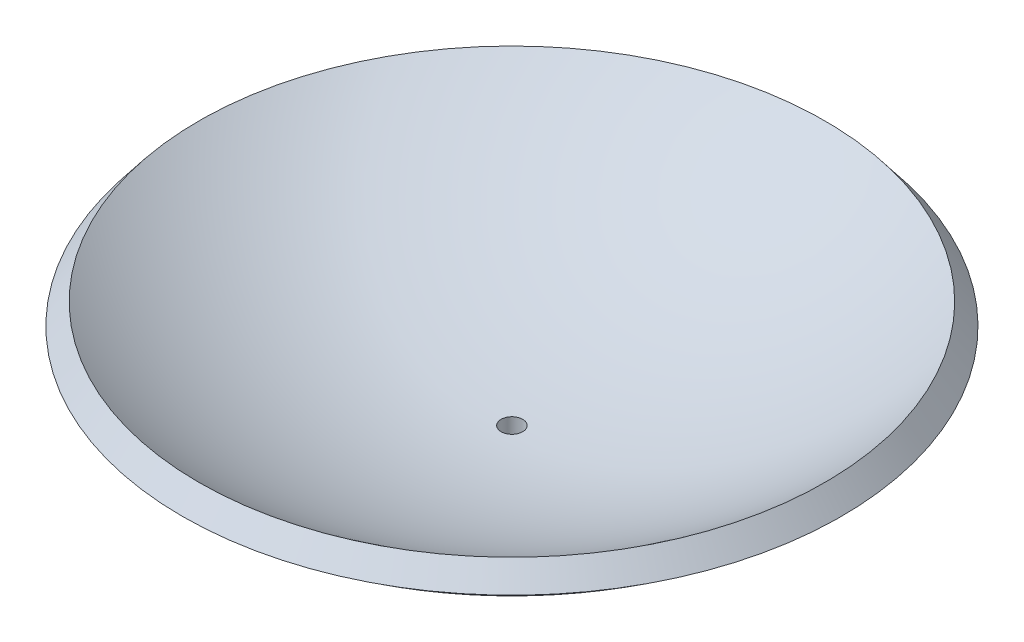
ISO-10303-21;
HEADER;
FILE_DESCRIPTION(('STEP AP214'),'2;1');
FILE_NAME('part.step','',(''),(''),'','','');
FILE_SCHEMA(('AUTOMOTIVE_DESIGN { 1 0 10303 214 1 1 1 1 }'));
ENDSEC;
DATA;
#1=APPLICATION_CONTEXT('core data for automotive mechanical design processes');
#2=APPLICATION_PROTOCOL_DEFINITION('international standard','automotive_design',2000,#1);
#3=PRODUCT_CONTEXT('',#1,'mechanical');
#4=PRODUCT('Part','Part','',(#3));
#5=PRODUCT_RELATED_PRODUCT_CATEGORY('part','',(#4));
#6=PRODUCT_DEFINITION_FORMATION('','',#4);
#7=PRODUCT_DEFINITION_CONTEXT('part definition',#1,'design');
#8=PRODUCT_DEFINITION('design','',#6,#7);
#9=PRODUCT_DEFINITION_SHAPE('','',#8);
#10=(LENGTH_UNIT() NAMED_UNIT(*) SI_UNIT(.MILLI.,.METRE.));
#11=(NAMED_UNIT(*) PLANE_ANGLE_UNIT() SI_UNIT($,.RADIAN.));
#12=(NAMED_UNIT(*) SI_UNIT($,.STERADIAN.) SOLID_ANGLE_UNIT());
#13=UNCERTAINTY_MEASURE_WITH_UNIT(LENGTH_MEASURE(1.E-05),#10,'distance_accuracy_value','');
#14=(GEOMETRIC_REPRESENTATION_CONTEXT(3) GLOBAL_UNCERTAINTY_ASSIGNED_CONTEXT((#13)) GLOBAL_UNIT_ASSIGNED_CONTEXT((#10,
#11,#12)) REPRESENTATION_CONTEXT('',''));
#15=CARTESIAN_POINT('',(0.,0.,0.));
#16=DIRECTION('',(0.,0.,1.));
#17=DIRECTION('',(1.,0.,0.));
#18=AXIS2_PLACEMENT_3D('',#15,#16,#17);
#19=CARTESIAN_POINT('',(0.,132.713404512541,0.));
#20=DIRECTION('',(0.,1.,0.));
#21=DIRECTION('',(-1.,0.,0.));
#22=AXIS2_PLACEMENT_3D('',#19,#20,#21);
#23=SPHERICAL_SURFACE('',#22,120.65);
#24=CARTESIAN_POINT('',(0.,12.0904124143922,0.));
#25=DIRECTION('',(0.,1.,0.));
#26=DIRECTION('',(0.,0.,1.));
#27=AXIS2_PLACEMENT_3D('',#24,#25,#26);
#28=CIRCLE('',#27,2.5527);
#29=CARTESIAN_POINT('',(0.,12.0904124143922,2.5527));
#30=VERTEX_POINT('',#29);
#31=EDGE_CURVE('E38',#30,#30,#28,.T.);
#32=ORIENTED_EDGE('',*,*,#31,.F.);
#33=EDGE_LOOP('',(#32));
#34=FACE_BOUND('',#33,.T.);
#35=CARTESIAN_POINT('',(0.,37.4634045125407,0.));
#36=DIRECTION('',(0.,1.,0.));
#37=DIRECTION('',(0.,0.,1.));
#38=AXIS2_PLACEMENT_3D('',#35,#36,#37);
#39=CIRCLE('',#38,74.0530890645353);
#40=CARTESIAN_POINT('',(0.,37.4634045125407,74.0530890645353));
#41=VERTEX_POINT('',#40);
#42=EDGE_CURVE('E10',#41,#41,#39,.T.);
#43=ORIENTED_EDGE('',*,*,#42,.T.);
#44=EDGE_LOOP('',(#43));
#45=FACE_BOUND('',#44,.T.);
#46=ADVANCED_FACE('F35',(#34,#45),#23,.F.);
#47=CARTESIAN_POINT('',(0.,37.4634045125407,0.));
#48=DIRECTION('',(0.,-1.,0.));
#49=DIRECTION('',(0.,0.,-1.));
#50=AXIS2_PLACEMENT_3D('',#47,#48,#49);
#51=CONICAL_SURFACE('',#50,74.0530890645353,0.66084529582297);
#52=CARTESIAN_POINT('',(0.,32.4502466178039,0.));
#53=DIRECTION('',(0.,1.,0.));
#54=DIRECTION('',(0.,0.,1.));
#55=AXIS2_PLACEMENT_3D('',#52,#53,#54);
#56=CIRCLE('',#55,77.9506200679319);
#57=CARTESIAN_POINT('',(0.,32.4502466178039,77.9506200679319));
#58=VERTEX_POINT('',#57);
#59=EDGE_CURVE('E42',#58,#58,#56,.T.);
#60=ORIENTED_EDGE('',*,*,#59,.T.);
#61=EDGE_LOOP('',(#60));
#62=FACE_BOUND('',#61,.T.);
#63=ORIENTED_EDGE('',*,*,#42,.F.);
#64=EDGE_LOOP('',(#63));
#65=FACE_BOUND('',#64,.T.);
#66=ADVANCED_FACE('F64',(#62,#65),#51,.T.);
#67=CARTESIAN_POINT('',(0.,132.713404512541,0.));
#68=DIRECTION('',(0.,1.,0.));
#69=DIRECTION('',(-1.,0.,0.));
#70=AXIS2_PLACEMENT_3D('',#67,#68,#69);
#71=SPHERICAL_SURFACE('',#70,127.);
#72=CARTESIAN_POINT('',(0.,6.35,0.));
#73=DIRECTION('',(0.,1.,0.));
#74=DIRECTION('',(0.,0.,1.));
#75=AXIS2_PLACEMENT_3D('',#72,#73,#74);
#76=CIRCLE('',#75,12.7);
#77=CARTESIAN_POINT('',(0.,6.35,12.7));
#78=VERTEX_POINT('',#77);
#79=EDGE_CURVE('E46',#78,#78,#76,.T.);
#80=ORIENTED_EDGE('',*,*,#79,.T.);
#81=EDGE_LOOP('',(#80));
#82=FACE_BOUND('',#81,.T.);
#83=ORIENTED_EDGE('',*,*,#59,.F.);
#84=EDGE_LOOP('',(#83));
#85=FACE_BOUND('',#84,.T.);
#86=ADVANCED_FACE('F68',(#82,#85),#71,.T.);
#87=CARTESIAN_POINT('',(0.,25.8108433387353,0.));
#88=DIRECTION('',(0.,1.,0.));
#89=DIRECTION('',(0.,0.,1.));
#90=AXIS2_PLACEMENT_3D('',#87,#88,#89);
#91=CYLINDRICAL_SURFACE('',#90,12.7);
#92=CARTESIAN_POINT('',(0.,0.,0.));
#93=DIRECTION('',(0.,1.,0.));
#94=DIRECTION('',(0.,0.,1.));
#95=AXIS2_PLACEMENT_3D('',#92,#93,#94);
#96=CIRCLE('',#95,12.7);
#97=CARTESIAN_POINT('',(0.,0.,12.7));
#98=VERTEX_POINT('',#97);
#99=EDGE_CURVE('E51',#98,#98,#96,.T.);
#100=ORIENTED_EDGE('',*,*,#99,.T.);
#101=EDGE_LOOP('',(#100));
#102=FACE_BOUND('',#101,.T.);
#103=ORIENTED_EDGE('',*,*,#79,.F.);
#104=EDGE_LOOP('',(#103));
#105=FACE_BOUND('',#104,.T.);
#106=ADVANCED_FACE('F73',(#102,#105),#91,.T.);
#107=CARTESIAN_POINT('',(0.,0.,0.));
#108=DIRECTION('',(0.,-1.,0.));
#109=DIRECTION('',(0.,0.,-1.));
#110=AXIS2_PLACEMENT_3D('',#107,#108,#109);
#111=PLANE('',#110);
#112=CARTESIAN_POINT('',(0.,0.,0.));
#113=DIRECTION('',(0.,-1.,0.));
#114=DIRECTION('',(0.,0.,-1.));
#115=AXIS2_PLACEMENT_3D('',#112,#113,#114);
#116=CIRCLE('',#115,2.5527);
#117=CARTESIAN_POINT('',(0.,0.,-2.5527));
#118=VERTEX_POINT('',#117);
#119=EDGE_CURVE('E54',#118,#118,#116,.T.);
#120=ORIENTED_EDGE('',*,*,#119,.F.);
#121=EDGE_LOOP('',(#120));
#122=FACE_BOUND('',#121,.T.);
#123=ORIENTED_EDGE('',*,*,#99,.F.);
#124=EDGE_LOOP('',(#123));
#125=FACE_BOUND('',#124,.T.);
#126=ADVANCED_FACE('F80',(#122,#125),#111,.T.);
#127=CARTESIAN_POINT('',(0.,0.,0.));
#128=DIRECTION('',(0.,-1.,0.));
#129=DIRECTION('',(0.,0.,-1.));
#130=AXIS2_PLACEMENT_3D('',#127,#128,#129);
#131=CYLINDRICAL_SURFACE('',#130,2.5527);
#132=ORIENTED_EDGE('',*,*,#31,.T.);
#133=EDGE_LOOP('',(#132));
#134=FACE_BOUND('',#133,.T.);
#135=ORIENTED_EDGE('',*,*,#119,.T.);
#136=EDGE_LOOP('',(#135));
#137=FACE_BOUND('',#136,.T.);
#138=ADVANCED_FACE('F61',(#134,#137),#131,.F.);
#139=CLOSED_SHELL('',(#46,#66,#86,#106,#126,#138));
#140=MANIFOLD_SOLID_BREP('B2',#139);
#141=ADVANCED_BREP_SHAPE_REPRESENTATION('',(#18,#140),#14);
#142=SHAPE_DEFINITION_REPRESENTATION(#9,#141);
ENDSEC;
END-ISO-10303-21;
